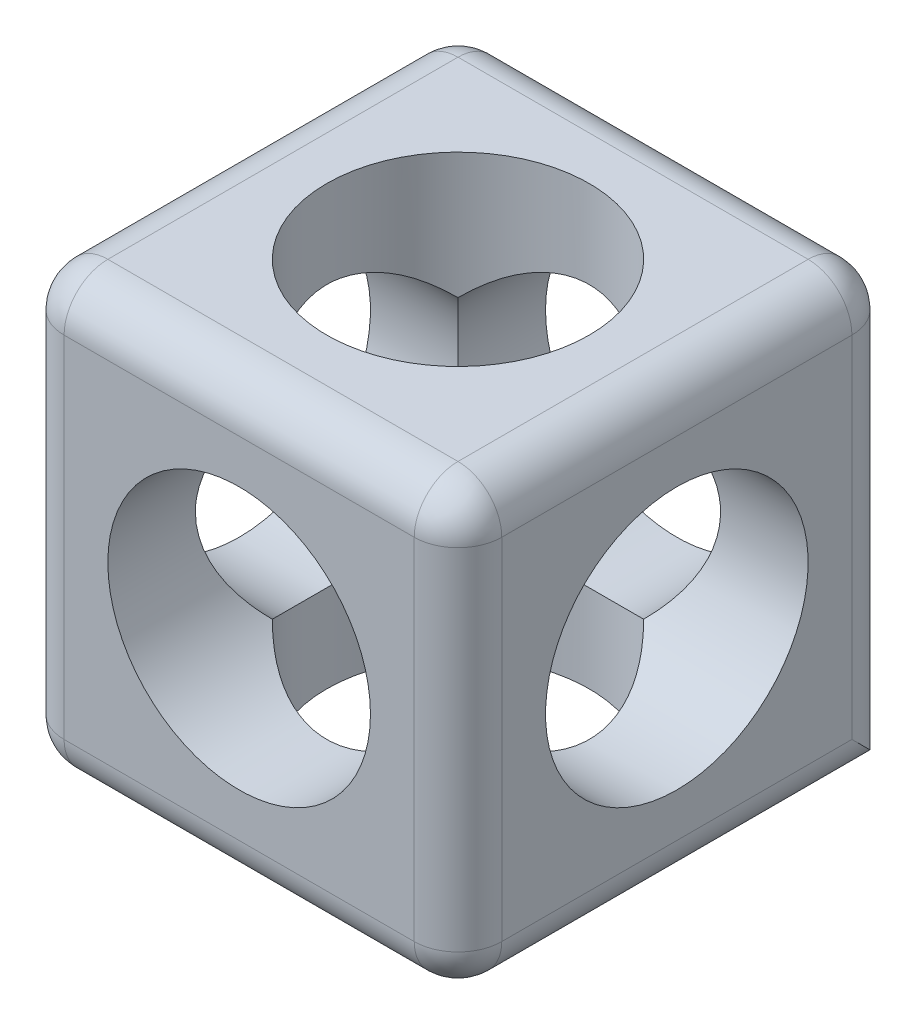
ISO-10303-21;
HEADER;
FILE_DESCRIPTION(('STEP AP214'),'2;1');
FILE_NAME('part.step','',(''),(''),'','','');
FILE_SCHEMA(('AUTOMOTIVE_DESIGN { 1 0 10303 214 1 1 1 1 }'));
ENDSEC;
DATA;
#1=APPLICATION_CONTEXT('core data for automotive mechanical design processes');
#2=APPLICATION_PROTOCOL_DEFINITION('international standard','automotive_design',2000,#1);
#3=PRODUCT_CONTEXT('',#1,'mechanical');
#4=PRODUCT('Part','Part','',(#3));
#5=PRODUCT_RELATED_PRODUCT_CATEGORY('part','',(#4));
#6=PRODUCT_DEFINITION_FORMATION('','',#4);
#7=PRODUCT_DEFINITION_CONTEXT('part definition',#1,'design');
#8=PRODUCT_DEFINITION('design','',#6,#7);
#9=PRODUCT_DEFINITION_SHAPE('','',#8);
#10=(LENGTH_UNIT() NAMED_UNIT(*) SI_UNIT(.MILLI.,.METRE.));
#11=(NAMED_UNIT(*) PLANE_ANGLE_UNIT() SI_UNIT($,.RADIAN.));
#12=(NAMED_UNIT(*) SI_UNIT($,.STERADIAN.) SOLID_ANGLE_UNIT());
#13=UNCERTAINTY_MEASURE_WITH_UNIT(LENGTH_MEASURE(1.E-05),#10,'distance_accuracy_value','');
#14=(GEOMETRIC_REPRESENTATION_CONTEXT(3) GLOBAL_UNCERTAINTY_ASSIGNED_CONTEXT((#13)) GLOBAL_UNIT_ASSIGNED_CONTEXT((#10,
#11,#12)) REPRESENTATION_CONTEXT('',''));
#15=CARTESIAN_POINT('',(0.,0.,0.));
#16=DIRECTION('',(0.,0.,1.));
#17=DIRECTION('',(1.,0.,0.));
#18=AXIS2_PLACEMENT_3D('',#15,#16,#17);
#19=CARTESIAN_POINT('',(-1.,0.5,0.5));
#20=DIRECTION('',(1.,0.,0.));
#21=DIRECTION('',(0.,1.,0.));
#22=AXIS2_PLACEMENT_3D('',#19,#20,#21);
#23=CYLINDRICAL_SURFACE('',#22,0.3);
#24=CARTESIAN_POINT('',(0.,0.5,0.5));
#25=DIRECTION('',(1.,0.,0.));
#26=DIRECTION('',(0.,1.,0.));
#27=AXIS2_PLACEMENT_3D('',#24,#25,#26);
#28=CIRCLE('',#27,0.3);
#29=CARTESIAN_POINT('',(0.,0.8,0.5));
#30=VERTEX_POINT('',#29);
#31=EDGE_CURVE('E384',#30,#30,#28,.T.);
#32=ORIENTED_EDGE('',*,*,#31,.T.);
#33=EDGE_LOOP('',(#32));
#34=FACE_BOUND('',#33,.T.);
#35=CARTESIAN_POINT('',(-0.5,0.5,0.5));
#36=DIRECTION('',(0.707106781186547,0.,0.707106781186547));
#37=DIRECTION('',(0.707106781186547,0.,-0.707106781186547));
#38=AXIS2_PLACEMENT_3D('',#35,#36,#37);
#39=ELLIPSE('',#38,0.424264068711928,0.3);
#40=CARTESIAN_POINT('',(-0.287867965644036,0.712132034355964,0.287867965644036));
#41=VERTEX_POINT('',#40);
#42=CARTESIAN_POINT('',(-0.287867965644036,0.287867965644036,0.287867965644036));
#43=VERTEX_POINT('',#42);
#44=EDGE_CURVE('E163',#41,#43,#39,.F.);
#45=ORIENTED_EDGE('',*,*,#44,.T.);
#46=CARTESIAN_POINT('',(-0.5,0.5,0.5));
#47=DIRECTION('',(0.707106781186547,0.707106781186548,0.));
#48=DIRECTION('',(0.707106781186548,-0.707106781186547,0.));
#49=AXIS2_PLACEMENT_3D('',#46,#47,#48);
#50=ELLIPSE('',#49,0.424264068711929,0.3);
#51=CARTESIAN_POINT('',(-0.287867965644036,0.287867965644036,0.712132034355964));
#52=VERTEX_POINT('',#51);
#53=EDGE_CURVE('E147',#43,#52,#50,.F.);
#54=ORIENTED_EDGE('',*,*,#53,.T.);
#55=CARTESIAN_POINT('',(-0.5,0.5,0.5));
#56=DIRECTION('',(0.707106781186547,0.,-0.707106781186547));
#57=DIRECTION('',(0.707106781186547,0.,0.707106781186547));
#58=AXIS2_PLACEMENT_3D('',#55,#56,#57);
#59=ELLIPSE('',#58,0.424264068711928,0.3);
#60=CARTESIAN_POINT('',(-0.287867965644036,0.712132034355964,0.712132034355964));
#61=VERTEX_POINT('',#60);
#62=EDGE_CURVE('E156',#52,#61,#59,.F.);
#63=ORIENTED_EDGE('',*,*,#62,.T.);
#64=CARTESIAN_POINT('',(-0.5,0.5,0.5));
#65=DIRECTION('',(0.707106781186548,-0.707106781186547,0.));
#66=DIRECTION('',(0.707106781186547,0.707106781186548,0.));
#67=AXIS2_PLACEMENT_3D('',#64,#65,#66);
#68=ELLIPSE('',#67,0.424264068711928,0.3);
#69=EDGE_CURVE('E395',#61,#41,#68,.F.);
#70=ORIENTED_EDGE('',*,*,#69,.T.);
#71=EDGE_LOOP('',(#45,#54,#63,#70));
#72=FACE_BOUND('',#71,.T.);
#73=ADVANCED_FACE('F35',(#34,#72),#23,.F.);
#74=CARTESIAN_POINT('',(0.,0.,1.));
#75=DIRECTION('',(-1.,0.,0.));
#76=DIRECTION('',(0.,-1.,0.));
#77=AXIS2_PLACEMENT_3D('',#74,#75,#76);
#78=PLANE('',#77);
#79=DIRECTION('',(0.,0.,-1.));
#80=VECTOR('',#79,1.);
#81=CARTESIAN_POINT('',(0.,0.1,1.));
#82=LINE('',#81,#80);
#83=CARTESIAN_POINT('',(0.,0.1,0.9));
#84=VERTEX_POINT('',#83);
#85=CARTESIAN_POINT('',(0.,0.1,0.1));
#86=VERTEX_POINT('',#85);
#87=EDGE_CURVE('E228',#84,#86,#82,.T.);
#88=ORIENTED_EDGE('',*,*,#87,.T.);
#89=DIRECTION('',(0.,1.,0.));
#90=VECTOR('',#89,1.);
#91=CARTESIAN_POINT('',(0.,0.,0.1));
#92=LINE('',#91,#90);
#93=CARTESIAN_POINT('',(0.,0.9,0.1));
#94=VERTEX_POINT('',#93);
#95=EDGE_CURVE('E234',#86,#94,#92,.T.);
#96=ORIENTED_EDGE('',*,*,#95,.T.);
#97=DIRECTION('',(0.,0.,-1.));
#98=VECTOR('',#97,1.);
#99=CARTESIAN_POINT('',(0.,0.9,1.));
#100=LINE('',#99,#98);
#101=CARTESIAN_POINT('',(0.,0.9,0.9));
#102=VERTEX_POINT('',#101);
#103=EDGE_CURVE('E232',#94,#102,#100,.F.);
#104=ORIENTED_EDGE('',*,*,#103,.T.);
#105=DIRECTION('',(0.,1.,0.));
#106=VECTOR('',#105,1.);
#107=CARTESIAN_POINT('',(0.,0.,0.9));
#108=LINE('',#107,#106);
#109=EDGE_CURVE('E230',#102,#84,#108,.F.);
#110=ORIENTED_EDGE('',*,*,#109,.T.);
#111=EDGE_LOOP('',(#88,#96,#104,#110));
#112=FACE_BOUND('',#111,.T.);
#113=ORIENTED_EDGE('',*,*,#31,.F.);
#114=EDGE_LOOP('',(#113));
#115=FACE_BOUND('',#114,.T.);
#116=ADVANCED_FACE('F356',(#112,#115),#78,.F.);
#117=CARTESIAN_POINT('',(0.,1.,1.));
#118=DIRECTION('',(0.,-1.,0.));
#119=DIRECTION('',(1.,0.,0.));
#120=AXIS2_PLACEMENT_3D('',#117,#118,#119);
#121=PLANE('',#120);
#122=CARTESIAN_POINT('',(-0.5,1.,0.5));
#123=DIRECTION('',(0.,1.,0.));
#124=DIRECTION('',(-1.,0.,0.));
#125=AXIS2_PLACEMENT_3D('',#122,#123,#124);
#126=CIRCLE('',#125,0.3);
#127=CARTESIAN_POINT('',(-0.8,1.,0.5));
#128=VERTEX_POINT('',#127);
#129=EDGE_CURVE('E200',#128,#128,#126,.T.);
#130=ORIENTED_EDGE('',*,*,#129,.F.);
#131=EDGE_LOOP('',(#130));
#132=FACE_BOUND('',#131,.T.);
#133=DIRECTION('',(0.,0.,-1.));
#134=VECTOR('',#133,1.);
#135=CARTESIAN_POINT('',(-0.1,1.,1.));
#136=LINE('',#135,#134);
#137=CARTESIAN_POINT('',(-0.1,1.,0.9));
#138=VERTEX_POINT('',#137);
#139=CARTESIAN_POINT('',(-0.1,1.,0.1));
#140=VERTEX_POINT('',#139);
#141=EDGE_CURVE('E224',#138,#140,#136,.T.);
#142=ORIENTED_EDGE('',*,*,#141,.T.);
#143=DIRECTION('',(-1.,0.,0.));
#144=VECTOR('',#143,1.);
#145=CARTESIAN_POINT('',(0.,1.,0.1));
#146=LINE('',#145,#144);
#147=CARTESIAN_POINT('',(-0.9,1.,0.1));
#148=VERTEX_POINT('',#147);
#149=EDGE_CURVE('E226',#140,#148,#146,.T.);
#150=ORIENTED_EDGE('',*,*,#149,.T.);
#151=DIRECTION('',(0.,0.,-1.));
#152=VECTOR('',#151,1.);
#153=CARTESIAN_POINT('',(-0.9,1.,1.));
#154=LINE('',#153,#152);
#155=CARTESIAN_POINT('',(-0.9,1.,0.9));
#156=VERTEX_POINT('',#155);
#157=EDGE_CURVE('E180',#148,#156,#154,.F.);
#158=ORIENTED_EDGE('',*,*,#157,.T.);
#159=DIRECTION('',(-1.,0.,0.));
#160=VECTOR('',#159,1.);
#161=CARTESIAN_POINT('',(0.,1.,0.9));
#162=LINE('',#161,#160);
#163=EDGE_CURVE('E182',#156,#138,#162,.F.);
#164=ORIENTED_EDGE('',*,*,#163,.T.);
#165=EDGE_LOOP('',(#142,#150,#158,#164));
#166=FACE_BOUND('',#165,.T.);
#167=ADVANCED_FACE('F290',(#132,#166),#121,.F.);
#168=CARTESIAN_POINT('',(-1.,0.,1.));
#169=DIRECTION('',(1.,0.,0.));
#170=DIRECTION('',(0.,0.,-1.));
#171=AXIS2_PLACEMENT_3D('',#168,#169,#170);
#172=PLANE('',#171);
#173=CARTESIAN_POINT('',(-1.,0.5,0.5));
#174=DIRECTION('',(1.,0.,0.));
#175=DIRECTION('',(0.,1.,0.));
#176=AXIS2_PLACEMENT_3D('',#173,#174,#175);
#177=CIRCLE('',#176,0.3);
#178=CARTESIAN_POINT('',(-1.,0.8,0.5));
#179=VERTEX_POINT('',#178);
#180=EDGE_CURVE('E329',#179,#179,#177,.T.);
#181=ORIENTED_EDGE('',*,*,#180,.T.);
#182=EDGE_LOOP('',(#181));
#183=FACE_BOUND('',#182,.T.);
#184=DIRECTION('',(0.,0.,-1.));
#185=VECTOR('',#184,1.);
#186=CARTESIAN_POINT('',(-1.,0.9,1.));
#187=LINE('',#186,#185);
#188=CARTESIAN_POINT('',(-1.,0.9,0.9));
#189=VERTEX_POINT('',#188);
#190=CARTESIAN_POINT('',(-1.,0.9,0.1));
#191=VERTEX_POINT('',#190);
#192=EDGE_CURVE('E185',#189,#191,#187,.T.);
#193=ORIENTED_EDGE('',*,*,#192,.T.);
#194=DIRECTION('',(0.,-1.,0.));
#195=VECTOR('',#194,1.);
#196=CARTESIAN_POINT('',(-1.,0.,0.1));
#197=LINE('',#196,#195);
#198=CARTESIAN_POINT('',(-1.,0.1,0.1));
#199=VERTEX_POINT('',#198);
#200=EDGE_CURVE('E202',#191,#199,#197,.T.);
#201=ORIENTED_EDGE('',*,*,#200,.T.);
#202=DIRECTION('',(0.,0.,-1.));
#203=VECTOR('',#202,1.);
#204=CARTESIAN_POINT('',(-1.,0.1,1.));
#205=LINE('',#204,#203);
#206=CARTESIAN_POINT('',(-1.,0.1,0.9));
#207=VERTEX_POINT('',#206);
#208=EDGE_CURVE('E190',#199,#207,#205,.F.);
#209=ORIENTED_EDGE('',*,*,#208,.T.);
#210=DIRECTION('',(0.,-1.,0.));
#211=VECTOR('',#210,1.);
#212=CARTESIAN_POINT('',(-1.,1.,0.9));
#213=LINE('',#212,#211);
#214=EDGE_CURVE('E188',#207,#189,#213,.F.);
#215=ORIENTED_EDGE('',*,*,#214,.T.);
#216=EDGE_LOOP('',(#193,#201,#209,#215));
#217=FACE_BOUND('',#216,.T.);
#218=ADVANCED_FACE('F460',(#183,#217),#172,.F.);
#219=CARTESIAN_POINT('',(0.,0.,1.));
#220=DIRECTION('',(0.,1.,0.));
#221=DIRECTION('',(0.,0.,1.));
#222=AXIS2_PLACEMENT_3D('',#219,#220,#221);
#223=PLANE('',#222);
#224=CARTESIAN_POINT('',(-0.5,0.,0.5));
#225=DIRECTION('',(0.,1.,0.));
#226=DIRECTION('',(-1.,0.,0.));
#227=AXIS2_PLACEMENT_3D('',#224,#225,#226);
#228=CIRCLE('',#227,0.3);
#229=CARTESIAN_POINT('',(-0.8,0.,0.5));
#230=VERTEX_POINT('',#229);
#231=EDGE_CURVE('E635',#230,#230,#228,.T.);
#232=ORIENTED_EDGE('',*,*,#231,.T.);
#233=EDGE_LOOP('',(#232));
#234=FACE_BOUND('',#233,.T.);
#235=DIRECTION('',(1.,0.,0.));
#236=VECTOR('',#235,1.);
#237=CARTESIAN_POINT('',(-0.9,0.,0.9));
#238=LINE('',#237,#236);
#239=CARTESIAN_POINT('',(-0.1,0.,0.9));
#240=VERTEX_POINT('',#239);
#241=CARTESIAN_POINT('',(-0.9,0.,0.9));
#242=VERTEX_POINT('',#241);
#243=EDGE_CURVE('E216',#240,#242,#238,.F.);
#244=ORIENTED_EDGE('',*,*,#243,.T.);
#245=DIRECTION('',(0.,0.,-1.));
#246=VECTOR('',#245,1.);
#247=CARTESIAN_POINT('',(-0.9,0.,1.));
#248=LINE('',#247,#246);
#249=CARTESIAN_POINT('',(-0.9,0.,0.));
#250=VERTEX_POINT('',#249);
#251=EDGE_CURVE('E220',#242,#250,#248,.T.);
#252=ORIENTED_EDGE('',*,*,#251,.T.);
#253=DIRECTION('',(1.,0.,0.));
#254=VECTOR('',#253,1.);
#255=CARTESIAN_POINT('',(0.,0.,0.));
#256=LINE('',#255,#254);
#257=CARTESIAN_POINT('',(-0.1,0.,0.));
#258=VERTEX_POINT('',#257);
#259=EDGE_CURVE('E324',#250,#258,#256,.T.);
#260=ORIENTED_EDGE('',*,*,#259,.T.);
#261=DIRECTION('',(0.,0.,-1.));
#262=VECTOR('',#261,1.);
#263=CARTESIAN_POINT('',(-0.1,0.,1.));
#264=LINE('',#263,#262);
#265=EDGE_CURVE('E218',#258,#240,#264,.F.);
#266=ORIENTED_EDGE('',*,*,#265,.T.);
#267=EDGE_LOOP('',(#244,#252,#260,#266));
#268=FACE_BOUND('',#267,.T.);
#269=ADVANCED_FACE('F323',(#234,#268),#223,.F.);
#270=CARTESIAN_POINT('',(0.,0.,1.));
#271=DIRECTION('',(0.,0.,1.));
#272=DIRECTION('',(1.,0.,0.));
#273=AXIS2_PLACEMENT_3D('',#270,#271,#272);
#274=PLANE('',#273);
#275=CARTESIAN_POINT('',(-0.5,0.5,1.));
#276=DIRECTION('',(0.,0.,-1.));
#277=DIRECTION('',(-1.,0.,0.));
#278=AXIS2_PLACEMENT_3D('',#275,#276,#277);
#279=CIRCLE('',#278,0.3);
#280=CARTESIAN_POINT('',(-0.8,0.5,1.));
#281=VERTEX_POINT('',#280);
#282=EDGE_CURVE('E386',#281,#281,#279,.T.);
#283=ORIENTED_EDGE('',*,*,#282,.T.);
#284=EDGE_LOOP('',(#283));
#285=FACE_BOUND('',#284,.T.);
#286=DIRECTION('',(1.,0.,0.));
#287=VECTOR('',#286,1.);
#288=CARTESIAN_POINT('',(0.,0.1,1.));
#289=LINE('',#288,#287);
#290=CARTESIAN_POINT('',(-0.9,0.1,1.));
#291=VERTEX_POINT('',#290);
#292=CARTESIAN_POINT('',(-0.1,0.1,1.));
#293=VERTEX_POINT('',#292);
#294=EDGE_CURVE('E44',#291,#293,#289,.T.);
#295=ORIENTED_EDGE('',*,*,#294,.T.);
#296=DIRECTION('',(0.,1.,0.));
#297=VECTOR('',#296,1.);
#298=CARTESIAN_POINT('',(-0.1,0.9,1.));
#299=LINE('',#298,#297);
#300=CARTESIAN_POINT('',(-0.1,0.9,1.));
#301=VERTEX_POINT('',#300);
#302=EDGE_CURVE('E11',#293,#301,#299,.T.);
#303=ORIENTED_EDGE('',*,*,#302,.T.);
#304=DIRECTION('',(-1.,0.,0.));
#305=VECTOR('',#304,1.);
#306=CARTESIAN_POINT('',(-1.,0.9,1.));
#307=LINE('',#306,#305);
#308=CARTESIAN_POINT('',(-0.9,0.9,1.));
#309=VERTEX_POINT('',#308);
#310=EDGE_CURVE('E178',#301,#309,#307,.T.);
#311=ORIENTED_EDGE('',*,*,#310,.T.);
#312=DIRECTION('',(0.,-1.,0.));
#313=VECTOR('',#312,1.);
#314=CARTESIAN_POINT('',(-0.9,0.,1.));
#315=LINE('',#314,#313);
#316=EDGE_CURVE('E176',#309,#291,#315,.T.);
#317=ORIENTED_EDGE('',*,*,#316,.T.);
#318=EDGE_LOOP('',(#295,#303,#311,#317));
#319=FACE_BOUND('',#318,.T.);
#320=ADVANCED_FACE('F306',(#285,#319),#274,.T.);
#321=CARTESIAN_POINT('',(0.,0.,0.));
#322=DIRECTION('',(0.,0.,1.));
#323=DIRECTION('',(1.,0.,0.));
#324=AXIS2_PLACEMENT_3D('',#321,#322,#323);
#325=PLANE('',#324);
#326=CARTESIAN_POINT('',(-0.5,0.5,0.));
#327=DIRECTION('',(0.,0.,-1.));
#328=DIRECTION('',(-1.,0.,0.));
#329=AXIS2_PLACEMENT_3D('',#326,#327,#328);
#330=CIRCLE('',#329,0.3);
#331=CARTESIAN_POINT('',(-0.8,0.5,0.));
#332=VERTEX_POINT('',#331);
#333=EDGE_CURVE('E389',#332,#332,#330,.T.);
#334=ORIENTED_EDGE('',*,*,#333,.F.);
#335=EDGE_LOOP('',(#334));
#336=FACE_BOUND('',#335,.T.);
#337=ORIENTED_EDGE('',*,*,#259,.F.);
#338=DIRECTION('',(0.,-1.,0.));
#339=VECTOR('',#338,1.);
#340=CARTESIAN_POINT('',(-0.9,0.,0.));
#341=LINE('',#340,#339);
#342=CARTESIAN_POINT('',(-0.9,0.9,0.));
#343=VERTEX_POINT('',#342);
#344=EDGE_CURVE('E209',#250,#343,#341,.F.);
#345=ORIENTED_EDGE('',*,*,#344,.T.);
#346=DIRECTION('',(-1.,0.,0.));
#347=VECTOR('',#346,1.);
#348=CARTESIAN_POINT('',(0.,0.9,0.));
#349=LINE('',#348,#347);
#350=CARTESIAN_POINT('',(-0.1,0.9,0.));
#351=VERTEX_POINT('',#350);
#352=EDGE_CURVE('E207',#343,#351,#349,.F.);
#353=ORIENTED_EDGE('',*,*,#352,.T.);
#354=DIRECTION('',(0.,1.,0.));
#355=VECTOR('',#354,1.);
#356=CARTESIAN_POINT('',(-0.1,0.,0.));
#357=LINE('',#356,#355);
#358=EDGE_CURVE('E205',#351,#258,#357,.F.);
#359=ORIENTED_EDGE('',*,*,#358,.T.);
#360=EDGE_LOOP('',(#337,#345,#353,#359));
#361=FACE_BOUND('',#360,.T.);
#362=ADVANCED_FACE('F328',(#336,#361),#325,.F.);
#363=CARTESIAN_POINT('',(-0.5,0.5,0.5));
#364=DIRECTION('',(0.707106781186547,0.,-0.707106781186547));
#365=DIRECTION('',(0.707106781186547,0.,0.707106781186547));
#366=AXIS2_PLACEMENT_3D('',#363,#364,#365);
#367=ELLIPSE('',#366,0.424264068711928,0.3);
#368=CARTESIAN_POINT('',(-0.712132034355964,0.287867965644036,0.287867965644036));
#369=VERTEX_POINT('',#368);
#370=CARTESIAN_POINT('',(-0.712132034355964,0.712132034355964,0.287867965644036));
#371=VERTEX_POINT('',#370);
#372=EDGE_CURVE('E168',#369,#371,#367,.T.);
#373=ORIENTED_EDGE('',*,*,#372,.T.);
#374=CARTESIAN_POINT('',(-0.5,0.5,0.5));
#375=DIRECTION('',(0.707106781186547,0.707106781186548,0.));
#376=DIRECTION('',(0.707106781186548,-0.707106781186547,0.));
#377=AXIS2_PLACEMENT_3D('',#374,#375,#376);
#378=ELLIPSE('',#377,0.424264068711929,0.3);
#379=CARTESIAN_POINT('',(-0.712132034355964,0.712132034355964,0.712132034355964));
#380=VERTEX_POINT('',#379);
#381=EDGE_CURVE('E392',#371,#380,#378,.T.);
#382=ORIENTED_EDGE('',*,*,#381,.T.);
#383=CARTESIAN_POINT('',(-0.5,0.5,0.5));
#384=DIRECTION('',(0.707106781186547,0.,0.707106781186547));
#385=DIRECTION('',(0.707106781186547,0.,-0.707106781186547));
#386=AXIS2_PLACEMENT_3D('',#383,#384,#385);
#387=ELLIPSE('',#386,0.424264068711928,0.3);
#388=CARTESIAN_POINT('',(-0.712132034355964,0.287867965644036,0.712132034355964));
#389=VERTEX_POINT('',#388);
#390=EDGE_CURVE('E171',#380,#389,#387,.T.);
#391=ORIENTED_EDGE('',*,*,#390,.T.);
#392=CARTESIAN_POINT('',(-0.5,0.5,0.5));
#393=DIRECTION('',(0.707106781186548,-0.707106781186547,0.));
#394=DIRECTION('',(0.707106781186547,0.707106781186548,0.));
#395=AXIS2_PLACEMENT_3D('',#392,#393,#394);
#396=ELLIPSE('',#395,0.424264068711928,0.3);
#397=EDGE_CURVE('E150',#389,#369,#396,.T.);
#398=ORIENTED_EDGE('',*,*,#397,.T.);
#399=EDGE_LOOP('',(#373,#382,#391,#398));
#400=FACE_BOUND('',#399,.T.);
#401=ORIENTED_EDGE('',*,*,#180,.F.);
#402=EDGE_LOOP('',(#401));
#403=FACE_BOUND('',#402,.T.);
#404=ADVANCED_FACE('F359',(#400,#403),#23,.F.);
#405=CARTESIAN_POINT('',(-0.5,0.5,1.));
#406=DIRECTION('',(0.,0.,-1.));
#407=DIRECTION('',(-1.,0.,0.));
#408=AXIS2_PLACEMENT_3D('',#405,#406,#407);
#409=CYLINDRICAL_SURFACE('',#408,0.3);
#410=ORIENTED_EDGE('',*,*,#333,.T.);
#411=EDGE_LOOP('',(#410));
#412=FACE_BOUND('',#411,.T.);
#413=ORIENTED_EDGE('',*,*,#372,.F.);
#414=CARTESIAN_POINT('',(-0.5,0.5,0.5));
#415=DIRECTION('',(0.,0.707106781186547,-0.707106781186547));
#416=DIRECTION('',(0.,-0.707106781186547,-0.707106781186547));
#417=AXIS2_PLACEMENT_3D('',#414,#415,#416);
#418=ELLIPSE('',#417,0.424264068711928,0.3);
#419=EDGE_CURVE('E164',#369,#43,#418,.F.);
#420=ORIENTED_EDGE('',*,*,#419,.T.);
#421=ORIENTED_EDGE('',*,*,#44,.F.);
#422=CARTESIAN_POINT('',(-0.5,0.5,0.5));
#423=DIRECTION('',(0.,-0.707106781186547,-0.707106781186547));
#424=DIRECTION('',(0.,0.707106781186547,-0.707106781186547));
#425=AXIS2_PLACEMENT_3D('',#422,#423,#424);
#426=ELLIPSE('',#425,0.424264068711928,0.3);
#427=EDGE_CURVE('E397',#41,#371,#426,.F.);
#428=ORIENTED_EDGE('',*,*,#427,.T.);
#429=EDGE_LOOP('',(#413,#420,#421,#428));
#430=FACE_BOUND('',#429,.T.);
#431=ADVANCED_FACE('F369',(#412,#430),#409,.F.);
#432=ORIENTED_EDGE('',*,*,#282,.F.);
#433=EDGE_LOOP('',(#432));
#434=FACE_BOUND('',#433,.T.);
#435=ORIENTED_EDGE('',*,*,#390,.F.);
#436=CARTESIAN_POINT('',(-0.5,0.5,0.5));
#437=DIRECTION('',(0.,0.707106781186547,-0.707106781186547));
#438=DIRECTION('',(0.,-0.707106781186547,-0.707106781186547));
#439=AXIS2_PLACEMENT_3D('',#436,#437,#438);
#440=ELLIPSE('',#439,0.424264068711928,0.3);
#441=EDGE_CURVE('E155',#380,#61,#440,.T.);
#442=ORIENTED_EDGE('',*,*,#441,.T.);
#443=ORIENTED_EDGE('',*,*,#62,.F.);
#444=CARTESIAN_POINT('',(-0.5,0.5,0.5));
#445=DIRECTION('',(0.,-0.707106781186547,-0.707106781186547));
#446=DIRECTION('',(0.,0.707106781186547,-0.707106781186547));
#447=AXIS2_PLACEMENT_3D('',#444,#445,#446);
#448=ELLIPSE('',#447,0.424264068711928,0.3);
#449=EDGE_CURVE('E144',#52,#389,#448,.T.);
#450=ORIENTED_EDGE('',*,*,#449,.T.);
#451=EDGE_LOOP('',(#435,#442,#443,#450));
#452=FACE_BOUND('',#451,.T.);
#453=ADVANCED_FACE('F167',(#434,#452),#409,.F.);
#454=CARTESIAN_POINT('',(-0.5,0.,0.5));
#455=DIRECTION('',(0.,1.,0.));
#456=DIRECTION('',(-1.,0.,0.));
#457=AXIS2_PLACEMENT_3D('',#454,#455,#456);
#458=CYLINDRICAL_SURFACE('',#457,0.3);
#459=ORIENTED_EDGE('',*,*,#231,.F.);
#460=EDGE_LOOP('',(#459));
#461=FACE_BOUND('',#460,.T.);
#462=ORIENTED_EDGE('',*,*,#397,.F.);
#463=ORIENTED_EDGE('',*,*,#449,.F.);
#464=ORIENTED_EDGE('',*,*,#53,.F.);
#465=ORIENTED_EDGE('',*,*,#419,.F.);
#466=EDGE_LOOP('',(#462,#463,#464,#465));
#467=FACE_BOUND('',#466,.T.);
#468=ADVANCED_FACE('F146',(#461,#467),#458,.F.);
#469=ORIENTED_EDGE('',*,*,#129,.T.);
#470=EDGE_LOOP('',(#469));
#471=FACE_BOUND('',#470,.T.);
#472=ORIENTED_EDGE('',*,*,#69,.F.);
#473=ORIENTED_EDGE('',*,*,#441,.F.);
#474=ORIENTED_EDGE('',*,*,#381,.F.);
#475=ORIENTED_EDGE('',*,*,#427,.F.);
#476=EDGE_LOOP('',(#472,#473,#474,#475));
#477=FACE_BOUND('',#476,.T.);
#478=ADVANCED_FACE('F407',(#471,#477),#458,.F.);
#479=CARTESIAN_POINT('',(-0.9,0.,0.9));
#480=DIRECTION('',(0.,1.,0.));
#481=DIRECTION('',(0.,0.,1.));
#482=AXIS2_PLACEMENT_3D('',#479,#480,#481);
#483=CYLINDRICAL_SURFACE('',#482,0.1);
#484=ORIENTED_EDGE('',*,*,#214,.F.);
#485=CARTESIAN_POINT('',(-0.9,0.1,0.9));
#486=DIRECTION('',(0.,1.,0.));
#487=DIRECTION('',(0.,0.,1.));
#488=AXIS2_PLACEMENT_3D('',#485,#486,#487);
#489=CIRCLE('',#488,0.1);
#490=EDGE_CURVE('E222',#207,#291,#489,.T.);
#491=ORIENTED_EDGE('',*,*,#490,.T.);
#492=ORIENTED_EDGE('',*,*,#316,.F.);
#493=CARTESIAN_POINT('',(-0.9,0.9,0.9));
#494=DIRECTION('',(0.,1.,0.));
#495=DIRECTION('',(0.,0.,1.));
#496=AXIS2_PLACEMENT_3D('',#493,#494,#495);
#497=CIRCLE('',#496,0.1);
#498=EDGE_CURVE('E197',#189,#309,#497,.T.);
#499=ORIENTED_EDGE('',*,*,#498,.F.);
#500=EDGE_LOOP('',(#484,#491,#492,#499));
#501=FACE_BOUND('',#500,.T.);
#502=ADVANCED_FACE('F304',(#501),#483,.T.);
#503=CARTESIAN_POINT('',(-0.9,0.9,1.));
#504=DIRECTION('',(0.,0.,-1.));
#505=DIRECTION('',(-1.,0.,0.));
#506=AXIS2_PLACEMENT_3D('',#503,#504,#505);
#507=CYLINDRICAL_SURFACE('',#506,0.1);
#508=ORIENTED_EDGE('',*,*,#157,.F.);
#509=CARTESIAN_POINT('',(-0.9,0.9,0.1));
#510=DIRECTION('',(0.,0.,-1.));
#511=DIRECTION('',(-1.,0.,0.));
#512=AXIS2_PLACEMENT_3D('',#509,#510,#511);
#513=CIRCLE('',#512,0.1);
#514=EDGE_CURVE('E212',#148,#191,#513,.F.);
#515=ORIENTED_EDGE('',*,*,#514,.T.);
#516=ORIENTED_EDGE('',*,*,#192,.F.);
#517=CARTESIAN_POINT('',(-0.9,0.9,0.9));
#518=DIRECTION('',(0.,0.,1.));
#519=DIRECTION('',(1.,0.,0.));
#520=AXIS2_PLACEMENT_3D('',#517,#518,#519);
#521=CIRCLE('',#520,0.1);
#522=EDGE_CURVE('E194',#156,#189,#521,.T.);
#523=ORIENTED_EDGE('',*,*,#522,.F.);
#524=EDGE_LOOP('',(#508,#515,#516,#523));
#525=FACE_BOUND('',#524,.T.);
#526=ADVANCED_FACE('F297',(#525),#507,.T.);
#527=CARTESIAN_POINT('',(-0.9,0.9,0.9));
#528=DIRECTION('',(0.,0.,1.));
#529=DIRECTION('',(1.,0.,0.));
#530=AXIS2_PLACEMENT_3D('',#527,#528,#529);
#531=SPHERICAL_SURFACE('',#530,0.1);
#532=ORIENTED_EDGE('',*,*,#522,.T.);
#533=ORIENTED_EDGE('',*,*,#498,.T.);
#534=CARTESIAN_POINT('',(-0.9,0.9,0.9));
#535=DIRECTION('',(-1.,0.,0.));
#536=DIRECTION('',(0.,0.,1.));
#537=AXIS2_PLACEMENT_3D('',#534,#535,#536);
#538=CIRCLE('',#537,0.1);
#539=EDGE_CURVE('E191',#156,#309,#538,.F.);
#540=ORIENTED_EDGE('',*,*,#539,.F.);
#541=EDGE_LOOP('',(#532,#533,#540));
#542=FACE_BOUND('',#541,.T.);
#543=ADVANCED_FACE('F300',(#542),#531,.T.);
#544=CARTESIAN_POINT('',(0.,0.9,0.9));
#545=DIRECTION('',(1.,0.,0.));
#546=DIRECTION('',(0.,1.,0.));
#547=AXIS2_PLACEMENT_3D('',#544,#545,#546);
#548=CYLINDRICAL_SURFACE('',#547,0.1);
#549=ORIENTED_EDGE('',*,*,#310,.F.);
#550=CARTESIAN_POINT('',(-0.1,0.9,0.9));
#551=DIRECTION('',(1.,0.,0.));
#552=DIRECTION('',(0.,1.,0.));
#553=AXIS2_PLACEMENT_3D('',#550,#551,#552);
#554=CIRCLE('',#553,0.1);
#555=EDGE_CURVE('E214',#301,#138,#554,.F.);
#556=ORIENTED_EDGE('',*,*,#555,.T.);
#557=ORIENTED_EDGE('',*,*,#163,.F.);
#558=ORIENTED_EDGE('',*,*,#539,.T.);
#559=EDGE_LOOP('',(#549,#556,#557,#558));
#560=FACE_BOUND('',#559,.T.);
#561=ADVANCED_FACE('F287',(#560),#548,.T.);
#562=CARTESIAN_POINT('',(-0.1,0.9,0.9));
#563=DIRECTION('',(0.,0.,1.));
#564=DIRECTION('',(1.,0.,0.));
#565=AXIS2_PLACEMENT_3D('',#562,#563,#564);
#566=SPHERICAL_SURFACE('',#565,0.1);
#567=CARTESIAN_POINT('',(-0.1,0.9,0.9));
#568=DIRECTION('',(0.,0.,-1.));
#569=DIRECTION('',(-1.,0.,0.));
#570=AXIS2_PLACEMENT_3D('',#567,#568,#569);
#571=CIRCLE('',#570,0.1);
#572=EDGE_CURVE('E266',#138,#102,#571,.T.);
#573=ORIENTED_EDGE('',*,*,#572,.F.);
#574=ORIENTED_EDGE('',*,*,#555,.F.);
#575=CARTESIAN_POINT('',(-0.1,0.9,0.9));
#576=DIRECTION('',(0.,-1.,0.));
#577=DIRECTION('',(0.,0.,-1.));
#578=AXIS2_PLACEMENT_3D('',#575,#576,#577);
#579=CIRCLE('',#578,0.1);
#580=EDGE_CURVE('E39',#102,#301,#579,.T.);
#581=ORIENTED_EDGE('',*,*,#580,.F.);
#582=EDGE_LOOP('',(#573,#574,#581));
#583=FACE_BOUND('',#582,.T.);
#584=ADVANCED_FACE('F37',(#583),#566,.T.);
#585=CARTESIAN_POINT('',(-0.1,0.,0.9));
#586=DIRECTION('',(0.,-1.,0.));
#587=DIRECTION('',(1.,0.,0.));
#588=AXIS2_PLACEMENT_3D('',#585,#586,#587);
#589=CYLINDRICAL_SURFACE('',#588,0.1);
#590=ORIENTED_EDGE('',*,*,#580,.T.);
#591=ORIENTED_EDGE('',*,*,#302,.F.);
#592=CARTESIAN_POINT('',(-0.1,0.1,0.9));
#593=DIRECTION('',(0.,-1.,0.));
#594=DIRECTION('',(0.,0.,-1.));
#595=AXIS2_PLACEMENT_3D('',#592,#593,#594);
#596=CIRCLE('',#595,0.1);
#597=EDGE_CURVE('E263',#84,#293,#596,.T.);
#598=ORIENTED_EDGE('',*,*,#597,.F.);
#599=ORIENTED_EDGE('',*,*,#109,.F.);
#600=EDGE_LOOP('',(#590,#591,#598,#599));
#601=FACE_BOUND('',#600,.T.);
#602=ADVANCED_FACE('F278',(#601),#589,.T.);
#603=CARTESIAN_POINT('',(-0.1,0.1,1.));
#604=DIRECTION('',(0.,0.,-1.));
#605=DIRECTION('',(-1.,0.,0.));
#606=AXIS2_PLACEMENT_3D('',#603,#604,#605);
#607=CYLINDRICAL_SURFACE('',#606,0.1);
#608=CARTESIAN_POINT('',(-0.1,0.1,0.9));
#609=DIRECTION('',(0.,0.,1.));
#610=DIRECTION('',(1.,0.,0.));
#611=AXIS2_PLACEMENT_3D('',#608,#609,#610);
#612=CIRCLE('',#611,0.1);
#613=EDGE_CURVE('E260',#240,#84,#612,.T.);
#614=ORIENTED_EDGE('',*,*,#613,.F.);
#615=ORIENTED_EDGE('',*,*,#265,.F.);
#616=CARTESIAN_POINT('',(-0.1,0.1,0.1));
#617=DIRECTION('',(0.,0.707106781186547,-0.707106781186547));
#618=DIRECTION('',(0.,-0.707106781186547,-0.707106781186547));
#619=AXIS2_PLACEMENT_3D('',#616,#617,#618);
#620=ELLIPSE('',#619,0.14142135623731,0.1);
#621=EDGE_CURVE('E268',#86,#258,#620,.T.);
#622=ORIENTED_EDGE('',*,*,#621,.F.);
#623=ORIENTED_EDGE('',*,*,#87,.F.);
#624=EDGE_LOOP('',(#614,#615,#622,#623));
#625=FACE_BOUND('',#624,.T.);
#626=ADVANCED_FACE('F526',(#625),#607,.T.);
#627=CARTESIAN_POINT('',(-0.1,0.,0.1));
#628=DIRECTION('',(0.,1.,0.));
#629=DIRECTION('',(-1.,0.,0.));
#630=AXIS2_PLACEMENT_3D('',#627,#628,#629);
#631=CYLINDRICAL_SURFACE('',#630,0.1);
#632=ORIENTED_EDGE('',*,*,#621,.T.);
#633=ORIENTED_EDGE('',*,*,#358,.F.);
#634=CARTESIAN_POINT('',(-0.1,0.9,0.1));
#635=DIRECTION('',(0.,1.,0.));
#636=DIRECTION('',(0.,0.,1.));
#637=AXIS2_PLACEMENT_3D('',#634,#635,#636);
#638=CIRCLE('',#637,0.1);
#639=EDGE_CURVE('E258',#94,#351,#638,.T.);
#640=ORIENTED_EDGE('',*,*,#639,.F.);
#641=ORIENTED_EDGE('',*,*,#95,.F.);
#642=EDGE_LOOP('',(#632,#633,#640,#641));
#643=FACE_BOUND('',#642,.T.);
#644=ADVANCED_FACE('F341',(#643),#631,.T.);
#645=CARTESIAN_POINT('',(-0.1,0.9,1.));
#646=DIRECTION('',(0.,0.,-1.));
#647=DIRECTION('',(-1.,0.,0.));
#648=AXIS2_PLACEMENT_3D('',#645,#646,#647);
#649=CYLINDRICAL_SURFACE('',#648,0.1);
#650=ORIENTED_EDGE('',*,*,#572,.T.);
#651=ORIENTED_EDGE('',*,*,#103,.F.);
#652=CARTESIAN_POINT('',(-0.1,0.9,0.1));
#653=DIRECTION('',(0.,0.,-1.));
#654=DIRECTION('',(-1.,0.,0.));
#655=AXIS2_PLACEMENT_3D('',#652,#653,#654);
#656=CIRCLE('',#655,0.1);
#657=EDGE_CURVE('E58',#140,#94,#656,.T.);
#658=ORIENTED_EDGE('',*,*,#657,.F.);
#659=ORIENTED_EDGE('',*,*,#141,.F.);
#660=EDGE_LOOP('',(#650,#651,#658,#659));
#661=FACE_BOUND('',#660,.T.);
#662=ADVANCED_FACE('F352',(#661),#649,.T.);
#663=CARTESIAN_POINT('',(-0.1,0.1,0.9));
#664=DIRECTION('',(0.,0.,1.));
#665=DIRECTION('',(1.,0.,0.));
#666=AXIS2_PLACEMENT_3D('',#663,#664,#665);
#667=SPHERICAL_SURFACE('',#666,0.1);
#668=ORIENTED_EDGE('',*,*,#613,.T.);
#669=ORIENTED_EDGE('',*,*,#597,.T.);
#670=CARTESIAN_POINT('',(-0.1,0.1,0.9));
#671=DIRECTION('',(1.,0.,0.));
#672=DIRECTION('',(0.,0.,-1.));
#673=AXIS2_PLACEMENT_3D('',#670,#671,#672);
#674=CIRCLE('',#673,0.1);
#675=EDGE_CURVE('E254',#240,#293,#674,.F.);
#676=ORIENTED_EDGE('',*,*,#675,.F.);
#677=EDGE_LOOP('',(#668,#669,#676));
#678=FACE_BOUND('',#677,.T.);
#679=ADVANCED_FACE('F345',(#678),#667,.T.);
#680=CARTESIAN_POINT('',(-0.1,0.9,0.1));
#681=DIRECTION('',(0.,0.,1.));
#682=DIRECTION('',(1.,0.,0.));
#683=AXIS2_PLACEMENT_3D('',#680,#681,#682);
#684=SPHERICAL_SURFACE('',#683,0.1);
#685=ORIENTED_EDGE('',*,*,#657,.T.);
#686=ORIENTED_EDGE('',*,*,#639,.T.);
#687=CARTESIAN_POINT('',(-0.1,0.9,0.1));
#688=DIRECTION('',(1.,0.,0.));
#689=DIRECTION('',(0.,1.,0.));
#690=AXIS2_PLACEMENT_3D('',#687,#688,#689);
#691=CIRCLE('',#690,0.1);
#692=EDGE_CURVE('E251',#140,#351,#691,.F.);
#693=ORIENTED_EDGE('',*,*,#692,.F.);
#694=EDGE_LOOP('',(#685,#686,#693));
#695=FACE_BOUND('',#694,.T.);
#696=ADVANCED_FACE('F343',(#695),#684,.T.);
#697=CARTESIAN_POINT('',(0.,0.1,0.9));
#698=DIRECTION('',(-1.,0.,0.));
#699=DIRECTION('',(0.,0.,1.));
#700=AXIS2_PLACEMENT_3D('',#697,#698,#699);
#701=CYLINDRICAL_SURFACE('',#700,0.1);
#702=ORIENTED_EDGE('',*,*,#675,.T.);
#703=ORIENTED_EDGE('',*,*,#294,.F.);
#704=CARTESIAN_POINT('',(-0.9,0.1,0.9));
#705=DIRECTION('',(-1.,0.,0.));
#706=DIRECTION('',(0.,0.,1.));
#707=AXIS2_PLACEMENT_3D('',#704,#705,#706);
#708=CIRCLE('',#707,0.1);
#709=EDGE_CURVE('E248',#242,#291,#708,.T.);
#710=ORIENTED_EDGE('',*,*,#709,.F.);
#711=ORIENTED_EDGE('',*,*,#243,.F.);
#712=EDGE_LOOP('',(#702,#703,#710,#711));
#713=FACE_BOUND('',#712,.T.);
#714=ADVANCED_FACE('F309',(#713),#701,.T.);
#715=CARTESIAN_POINT('',(0.,0.9,0.1));
#716=DIRECTION('',(-1.,0.,0.));
#717=DIRECTION('',(0.,-1.,0.));
#718=AXIS2_PLACEMENT_3D('',#715,#716,#717);
#719=CYLINDRICAL_SURFACE('',#718,0.1);
#720=ORIENTED_EDGE('',*,*,#692,.T.);
#721=ORIENTED_EDGE('',*,*,#352,.F.);
#722=CARTESIAN_POINT('',(-0.9,0.9,0.1));
#723=DIRECTION('',(-1.,0.,0.));
#724=DIRECTION('',(0.,0.,1.));
#725=AXIS2_PLACEMENT_3D('',#722,#723,#724);
#726=CIRCLE('',#725,0.1);
#727=EDGE_CURVE('E245',#148,#343,#726,.T.);
#728=ORIENTED_EDGE('',*,*,#727,.F.);
#729=ORIENTED_EDGE('',*,*,#149,.F.);
#730=EDGE_LOOP('',(#720,#721,#728,#729));
#731=FACE_BOUND('',#730,.T.);
#732=ADVANCED_FACE('F340',(#731),#719,.T.);
#733=CARTESIAN_POINT('',(-0.9,0.1,0.9));
#734=DIRECTION('',(0.,0.,1.));
#735=DIRECTION('',(1.,0.,0.));
#736=AXIS2_PLACEMENT_3D('',#733,#734,#735);
#737=SPHERICAL_SURFACE('',#736,0.1);
#738=ORIENTED_EDGE('',*,*,#709,.T.);
#739=ORIENTED_EDGE('',*,*,#490,.F.);
#740=CARTESIAN_POINT('',(-0.9,0.1,0.9));
#741=DIRECTION('',(0.,0.,-1.));
#742=DIRECTION('',(-1.,0.,0.));
#743=AXIS2_PLACEMENT_3D('',#740,#741,#742);
#744=CIRCLE('',#743,0.1);
#745=EDGE_CURVE('E242',#242,#207,#744,.T.);
#746=ORIENTED_EDGE('',*,*,#745,.F.);
#747=EDGE_LOOP('',(#738,#739,#746));
#748=FACE_BOUND('',#747,.T.);
#749=ADVANCED_FACE('F314',(#748),#737,.T.);
#750=CARTESIAN_POINT('',(-0.9,0.9,0.1));
#751=DIRECTION('',(0.,0.,1.));
#752=DIRECTION('',(1.,0.,0.));
#753=AXIS2_PLACEMENT_3D('',#750,#751,#752);
#754=SPHERICAL_SURFACE('',#753,0.1);
#755=ORIENTED_EDGE('',*,*,#514,.F.);
#756=ORIENTED_EDGE('',*,*,#727,.T.);
#757=CARTESIAN_POINT('',(-0.9,0.9,0.1));
#758=DIRECTION('',(0.,-1.,0.));
#759=DIRECTION('',(0.,0.,-1.));
#760=AXIS2_PLACEMENT_3D('',#757,#758,#759);
#761=CIRCLE('',#760,0.1);
#762=EDGE_CURVE('E240',#191,#343,#761,.T.);
#763=ORIENTED_EDGE('',*,*,#762,.F.);
#764=EDGE_LOOP('',(#755,#756,#763));
#765=FACE_BOUND('',#764,.T.);
#766=ADVANCED_FACE('F338',(#765),#754,.T.);
#767=CARTESIAN_POINT('',(-0.9,0.1,1.));
#768=DIRECTION('',(0.,0.,-1.));
#769=DIRECTION('',(-1.,0.,0.));
#770=AXIS2_PLACEMENT_3D('',#767,#768,#769);
#771=CYLINDRICAL_SURFACE('',#770,0.1);
#772=ORIENTED_EDGE('',*,*,#745,.T.);
#773=ORIENTED_EDGE('',*,*,#208,.F.);
#774=CARTESIAN_POINT('',(-0.9,0.1,0.1));
#775=DIRECTION('',(0.,0.707106781186547,-0.707106781186547));
#776=DIRECTION('',(0.,-0.707106781186547,-0.707106781186547));
#777=AXIS2_PLACEMENT_3D('',#774,#775,#776);
#778=ELLIPSE('',#777,0.14142135623731,0.1);
#779=EDGE_CURVE('E238',#250,#199,#778,.T.);
#780=ORIENTED_EDGE('',*,*,#779,.F.);
#781=ORIENTED_EDGE('',*,*,#251,.F.);
#782=EDGE_LOOP('',(#772,#773,#780,#781));
#783=FACE_BOUND('',#782,.T.);
#784=ADVANCED_FACE('F319',(#783),#771,.T.);
#785=CARTESIAN_POINT('',(-0.9,0.,0.1));
#786=DIRECTION('',(0.,-1.,0.));
#787=DIRECTION('',(0.,0.,-1.));
#788=AXIS2_PLACEMENT_3D('',#785,#786,#787);
#789=CYLINDRICAL_SURFACE('',#788,0.1);
#790=ORIENTED_EDGE('',*,*,#762,.T.);
#791=ORIENTED_EDGE('',*,*,#344,.F.);
#792=ORIENTED_EDGE('',*,*,#779,.T.);
#793=ORIENTED_EDGE('',*,*,#200,.F.);
#794=EDGE_LOOP('',(#790,#791,#792,#793));
#795=FACE_BOUND('',#794,.T.);
#796=ADVANCED_FACE('F332',(#795),#789,.T.);
#797=CLOSED_SHELL('',(#73,#116,#167,#218,#269,#320,#362,#404,#431,#453,#468,#478,#502,#526,#543,
#561,#584,#602,#626,#644,#662,#679,#696,#714,#732,#749,#766,#784,#796));
#798=MANIFOLD_SOLID_BREP('B2',#797);
#799=ADVANCED_BREP_SHAPE_REPRESENTATION('',(#18,#798),#14);
#800=SHAPE_DEFINITION_REPRESENTATION(#9,#799);
ENDSEC;
END-ISO-10303-21;
